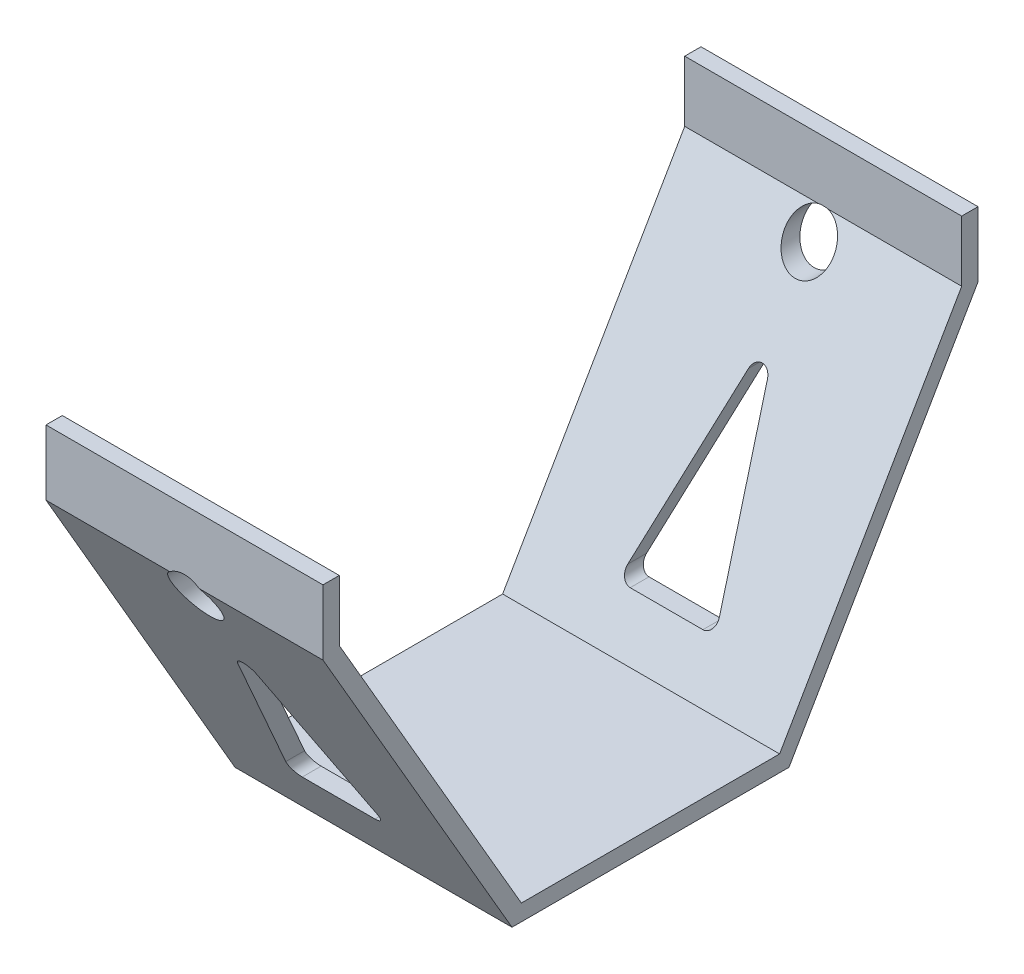
ISO-10303-21;
HEADER;
FILE_DESCRIPTION(('STEP AP214'),'2;1');
FILE_NAME('part.step','',(''),(''),'','','');
FILE_SCHEMA(('AUTOMOTIVE_DESIGN { 1 0 10303 214 1 1 1 1 }'));
ENDSEC;
DATA;
#1=APPLICATION_CONTEXT('core data for automotive mechanical design processes');
#2=APPLICATION_PROTOCOL_DEFINITION('international standard','automotive_design',2000,#1);
#3=PRODUCT_CONTEXT('',#1,'mechanical');
#4=PRODUCT('Part','Part','',(#3));
#5=PRODUCT_RELATED_PRODUCT_CATEGORY('part','',(#4));
#6=PRODUCT_DEFINITION_FORMATION('','',#4);
#7=PRODUCT_DEFINITION_CONTEXT('part definition',#1,'design');
#8=PRODUCT_DEFINITION('design','',#6,#7);
#9=PRODUCT_DEFINITION_SHAPE('','',#8);
#10=(LENGTH_UNIT() NAMED_UNIT(*) SI_UNIT(.MILLI.,.METRE.));
#11=(NAMED_UNIT(*) PLANE_ANGLE_UNIT() SI_UNIT($,.RADIAN.));
#12=(NAMED_UNIT(*) SI_UNIT($,.STERADIAN.) SOLID_ANGLE_UNIT());
#13=UNCERTAINTY_MEASURE_WITH_UNIT(LENGTH_MEASURE(1.E-05),#10,'distance_accuracy_value','');
#14=(GEOMETRIC_REPRESENTATION_CONTEXT(3) GLOBAL_UNCERTAINTY_ASSIGNED_CONTEXT((#13)) GLOBAL_UNIT_ASSIGNED_CONTEXT((#10,
#11,#12)) REPRESENTATION_CONTEXT('',''));
#15=CARTESIAN_POINT('',(0.,0.,0.));
#16=DIRECTION('',(0.,0.,1.));
#17=DIRECTION('',(1.,0.,0.));
#18=AXIS2_PLACEMENT_3D('',#15,#16,#17);
#19=CARTESIAN_POINT('',(42.5,0.,-95.5));
#20=DIRECTION('',(0.,0.,1.));
#21=DIRECTION('',(1.,0.,0.));
#22=AXIS2_PLACEMENT_3D('',#19,#20,#21);
#23=PLANE('',#22);
#24=CARTESIAN_POINT('',(0.,94.,-95.5));
#25=DIRECTION('',(0.,0.,1.));
#26=DIRECTION('',(1.,0.,0.));
#27=AXIS2_PLACEMENT_3D('',#24,#25,#26);
#28=CIRCLE('',#27,7.5);
#29=CARTESIAN_POINT('',(1.51657582993524,101.345066218358,-95.5));
#30=VERTEX_POINT('',#29);
#31=CARTESIAN_POINT('',(-1.5165758299352,101.345066218358,-95.5));
#32=VERTEX_POINT('',#31);
#33=EDGE_CURVE('E51',#30,#32,#28,.T.);
#34=ORIENTED_EDGE('',*,*,#33,.F.);
#35=DIRECTION('',(-1.,0.,0.));
#36=VECTOR('',#35,1.);
#37=CARTESIAN_POINT('',(42.5,101.345066218358,-95.5));
#38=LINE('',#37,#36);
#39=CARTESIAN_POINT('',(42.5,101.345066218358,-95.5));
#40=VERTEX_POINT('',#39);
#41=EDGE_CURVE('E271',#40,#30,#38,.T.);
#42=ORIENTED_EDGE('',*,*,#41,.F.);
#43=DIRECTION('',(0.,1.,0.));
#44=VECTOR('',#43,1.);
#45=CARTESIAN_POINT('',(42.5,0.,-95.5));
#46=LINE('',#45,#44);
#47=CARTESIAN_POINT('',(42.5,120.,-95.5));
#48=VERTEX_POINT('',#47);
#49=EDGE_CURVE('E388',#40,#48,#46,.T.);
#50=ORIENTED_EDGE('',*,*,#49,.T.);
#51=DIRECTION('',(-1.,0.,0.));
#52=VECTOR('',#51,1.);
#53=CARTESIAN_POINT('',(42.5,120.,-95.5));
#54=LINE('',#53,#52);
#55=CARTESIAN_POINT('',(-42.5,120.,-95.5));
#56=VERTEX_POINT('',#55);
#57=EDGE_CURVE('E444',#48,#56,#54,.T.);
#58=ORIENTED_EDGE('',*,*,#57,.T.);
#59=DIRECTION('',(0.,1.,0.));
#60=VECTOR('',#59,1.);
#61=CARTESIAN_POINT('',(-42.5,0.,-95.5));
#62=LINE('',#61,#60);
#63=CARTESIAN_POINT('',(-42.5,101.345066218358,-95.5));
#64=VERTEX_POINT('',#63);
#65=EDGE_CURVE('E387',#64,#56,#62,.T.);
#66=ORIENTED_EDGE('',*,*,#65,.F.);
#67=EDGE_CURVE('E270',#32,#64,#38,.T.);
#68=ORIENTED_EDGE('',*,*,#67,.F.);
#69=EDGE_LOOP('',(#34,#42,#50,#58,#66,#68));
#70=FACE_BOUND('',#69,.T.);
#71=ADVANCED_FACE('F37',(#70),#23,.T.);
#72=CARTESIAN_POINT('',(42.5,-15.9364858755945,-27.4766997855078));
#73=DIRECTION('',(0.,-0.501718089771846,-0.865031189261803));
#74=DIRECTION('',(0.,0.865031189261803,-0.501718089771846));
#75=AXIS2_PLACEMENT_3D('',#72,#73,#74);
#76=PLANE('',#75);
#77=DIRECTION('',(-1.,0.,0.));
#78=VECTOR('',#77,1.);
#79=CARTESIAN_POINT('',(42.5,18.4508732143203,-47.4213680576584));
#80=LINE('',#79,#78);
#81=CARTESIAN_POINT('',(11.1576707807868,18.4508732143203,-47.4213680576584));
#82=VERTEX_POINT('',#81);
#83=CARTESIAN_POINT('',(-11.1576707807868,18.4508732143203,-47.4213680576584));
#84=VERTEX_POINT('',#83);
#85=EDGE_CURVE('E354',#82,#84,#80,.T.);
#86=ORIENTED_EDGE('',*,*,#85,.T.);
#87=CARTESIAN_POINT('',(-11.1576707807868,21.4508732143203,-49.1613680576584));
#88=DIRECTION('',(0.,-0.501718089771846,-0.865031189261803));
#89=DIRECTION('',(0.,0.865031189261803,-0.501718089771846));
#90=AXIS2_PLACEMENT_3D('',#87,#88,#89);
#91=ELLIPSE('',#90,3.46808304398842,3.);
#92=CARTESIAN_POINT('',(-14.0680982812228,22.1784800894293,-49.5833800452217));
#93=VERTEX_POINT('',#92);
#94=EDGE_CURVE('E320',#84,#93,#91,.T.);
#95=ORIENTED_EDGE('',*,*,#94,.T.);
#96=DIRECTION('',(0.211371618850005,0.845486475400022,-0.490382155732013));
#97=VECTOR('',#96,1.);
#98=CARTESIAN_POINT('',(-20.643767726028,-4.12419768979163,-34.3278269332735));
#99=LINE('',#98,#97);
#100=CARTESIAN_POINT('',(-2.910427500436,66.8091632125764,-75.4691762566469));
#101=VERTEX_POINT('',#100);
#102=EDGE_CURVE('E366',#93,#101,#99,.T.);
#103=ORIENTED_EDGE('',*,*,#102,.T.);
#104=CARTESIAN_POINT('',(0.,66.0815563374673,-75.0471642690837));
#105=DIRECTION('',(0.,-0.501718089771846,-0.865031189261803));
#106=DIRECTION('',(0.,0.865031189261803,-0.501718089771846));
#107=AXIS2_PLACEMENT_3D('',#104,#105,#106);
#108=ELLIPSE('',#107,3.46808304398842,3.);
#109=CARTESIAN_POINT('',(2.91042750043599,66.8091632125764,-75.4691762566469));
#110=VERTEX_POINT('',#109);
#111=EDGE_CURVE('E316',#101,#110,#108,.T.);
#112=ORIENTED_EDGE('',*,*,#111,.T.);
#113=DIRECTION('',(0.211371618850005,-0.845486475400022,0.490382155732013));
#114=VECTOR('',#113,1.);
#115=CARTESIAN_POINT('',(24.4413944327261,-19.3147045165841,-25.5173329737338));
#116=LINE('',#115,#114);
#117=CARTESIAN_POINT('',(14.0680982812227,22.1784800894293,-49.5833800452217));
#118=VERTEX_POINT('',#117);
#119=EDGE_CURVE('E381',#110,#118,#116,.T.);
#120=ORIENTED_EDGE('',*,*,#119,.T.);
#121=CARTESIAN_POINT('',(11.1576707807868,21.4508732143203,-49.1613680576584));
#122=DIRECTION('',(0.,-0.501718089771846,-0.865031189261803));
#123=DIRECTION('',(0.,0.865031189261803,-0.501718089771846));
#124=AXIS2_PLACEMENT_3D('',#121,#122,#123);
#125=ELLIPSE('',#124,3.46808304398842,3.);
#126=EDGE_CURVE('E324',#118,#82,#125,.T.);
#127=ORIENTED_EDGE('',*,*,#126,.T.);
#128=EDGE_LOOP('',(#86,#95,#103,#112,#120,#127));
#129=FACE_BOUND('',#128,.T.);
#130=ORIENTED_EDGE('',*,*,#41,.T.);
#131=CARTESIAN_POINT('',(0.,94.,-91.2398615933527));
#132=DIRECTION('',(0.,-0.501718089771846,-0.865031189261803));
#133=DIRECTION('',(0.,-0.865031189261803,0.501718089771846));
#134=AXIS2_PLACEMENT_3D('',#131,#132,#133);
#135=ELLIPSE('',#134,8.67020760997106,7.5);
#136=EDGE_CURVE('E497',#30,#32,#135,.T.);
#137=ORIENTED_EDGE('',*,*,#136,.T.);
#138=ORIENTED_EDGE('',*,*,#67,.T.);
#139=DIRECTION('',(0.,-0.865031189261803,0.501718089771846));
#140=VECTOR('',#139,1.);
#141=CARTESIAN_POINT('',(-42.5,-15.9364858755945,-27.4766997855078));
#142=LINE('',#141,#140);
#143=CARTESIAN_POINT('',(-42.5,5.,-39.6198615933526));
#144=VERTEX_POINT('',#143);
#145=EDGE_CURVE('E417',#64,#144,#142,.T.);
#146=ORIENTED_EDGE('',*,*,#145,.T.);
#147=DIRECTION('',(-1.,0.,0.));
#148=VECTOR('',#147,1.);
#149=CARTESIAN_POINT('',(42.5,5.,-39.6198615933526));
#150=LINE('',#149,#148);
#151=CARTESIAN_POINT('',(42.5,5.,-39.6198615933526));
#152=VERTEX_POINT('',#151);
#153=EDGE_CURVE('E268',#152,#144,#150,.T.);
#154=ORIENTED_EDGE('',*,*,#153,.F.);
#155=DIRECTION('',(0.,-0.865031189261803,0.501718089771846));
#156=VECTOR('',#155,1.);
#157=CARTESIAN_POINT('',(42.5,-15.9364858755945,-27.4766997855078));
#158=LINE('',#157,#156);
#159=EDGE_CURVE('E391',#40,#152,#158,.T.);
#160=ORIENTED_EDGE('',*,*,#159,.F.);
#161=EDGE_LOOP('',(#130,#137,#138,#146,#154,#160));
#162=FACE_BOUND('',#161,.T.);
#163=ADVANCED_FACE('F460',(#129,#162),#76,.F.);
#164=CARTESIAN_POINT('',(42.5,5.,0.));
#165=DIRECTION('',(0.,1.,0.));
#166=DIRECTION('',(0.,0.,1.));
#167=AXIS2_PLACEMENT_3D('',#164,#165,#166);
#168=PLANE('',#167);
#169=DIRECTION('',(0.,0.,-1.));
#170=VECTOR('',#169,1.);
#171=CARTESIAN_POINT('',(-42.5,5.,0.));
#172=LINE('',#171,#170);
#173=CARTESIAN_POINT('',(-42.5,5.,39.6198615933526));
#174=VERTEX_POINT('',#173);
#175=EDGE_CURVE('E420',#174,#144,#172,.T.);
#176=ORIENTED_EDGE('',*,*,#175,.F.);
#177=DIRECTION('',(-1.,0.,0.));
#178=VECTOR('',#177,1.);
#179=CARTESIAN_POINT('',(42.5,5.,39.6198615933526));
#180=LINE('',#179,#178);
#181=CARTESIAN_POINT('',(42.5,5.,39.6198615933526));
#182=VERTEX_POINT('',#181);
#183=EDGE_CURVE('E266',#182,#174,#180,.T.);
#184=ORIENTED_EDGE('',*,*,#183,.F.);
#185=DIRECTION('',(0.,0.,-1.));
#186=VECTOR('',#185,1.);
#187=CARTESIAN_POINT('',(42.5,5.,0.));
#188=LINE('',#187,#186);
#189=EDGE_CURVE('E394',#182,#152,#188,.T.);
#190=ORIENTED_EDGE('',*,*,#189,.T.);
#191=ORIENTED_EDGE('',*,*,#153,.T.);
#192=EDGE_LOOP('',(#176,#184,#190,#191));
#193=FACE_BOUND('',#192,.T.);
#194=ADVANCED_FACE('F506',(#193),#168,.T.);
#195=CARTESIAN_POINT('',(42.5,-15.9364858755945,27.4766997855078));
#196=DIRECTION('',(0.,0.501718089771846,-0.865031189261803));
#197=DIRECTION('',(0.,0.865031189261804,0.501718089771846));
#198=AXIS2_PLACEMENT_3D('',#195,#196,#197);
#199=PLANE('',#198);
#200=CARTESIAN_POINT('',(0.,94.,91.2398615933526));
#201=DIRECTION('',(0.,0.501718089771846,-0.865031189261803));
#202=DIRECTION('',(0.,0.865031189261804,0.501718089771846));
#203=AXIS2_PLACEMENT_3D('',#200,#201,#202);
#204=ELLIPSE('',#203,8.67020760997106,7.5);
#205=CARTESIAN_POINT('',(1.51657582993516,101.345066218358,95.5));
#206=VERTEX_POINT('',#205);
#207=CARTESIAN_POINT('',(-1.51657582993516,101.345066218358,95.5));
#208=VERTEX_POINT('',#207);
#209=EDGE_CURVE('E58',#206,#208,#204,.T.);
#210=ORIENTED_EDGE('',*,*,#209,.F.);
#211=DIRECTION('',(-1.,0.,0.));
#212=VECTOR('',#211,1.);
#213=CARTESIAN_POINT('',(42.5,101.345066218358,95.5));
#214=LINE('',#213,#212);
#215=CARTESIAN_POINT('',(42.5,101.345066218358,95.5));
#216=VERTEX_POINT('',#215);
#217=EDGE_CURVE('E263',#216,#206,#214,.T.);
#218=ORIENTED_EDGE('',*,*,#217,.F.);
#219=DIRECTION('',(0.,-0.865031189261803,-0.501718089771846));
#220=VECTOR('',#219,1.);
#221=CARTESIAN_POINT('',(42.5,-15.9364858755945,27.4766997855078));
#222=LINE('',#221,#220);
#223=EDGE_CURVE('E397',#216,#182,#222,.T.);
#224=ORIENTED_EDGE('',*,*,#223,.T.);
#225=ORIENTED_EDGE('',*,*,#183,.T.);
#226=DIRECTION('',(0.,-0.865031189261803,-0.501718089771846));
#227=VECTOR('',#226,1.);
#228=CARTESIAN_POINT('',(-42.5,-15.9364858755945,27.4766997855078));
#229=LINE('',#228,#227);
#230=CARTESIAN_POINT('',(-42.5,101.345066218358,95.5));
#231=VERTEX_POINT('',#230);
#232=EDGE_CURVE('E423',#231,#174,#229,.T.);
#233=ORIENTED_EDGE('',*,*,#232,.F.);
#234=EDGE_CURVE('E262',#208,#231,#214,.T.);
#235=ORIENTED_EDGE('',*,*,#234,.F.);
#236=EDGE_LOOP('',(#210,#218,#224,#225,#233,#235));
#237=FACE_BOUND('',#236,.T.);
#238=DIRECTION('',(0.211371618850006,-0.845486475400022,-0.490382155732013));
#239=VECTOR('',#238,1.);
#240=CARTESIAN_POINT('',(24.4413944327261,-19.3147045165841,25.5173329737339));
#241=LINE('',#240,#239);
#242=CARTESIAN_POINT('',(2.91042750043599,66.8091632125764,75.4691762566469));
#243=VERTEX_POINT('',#242);
#244=CARTESIAN_POINT('',(14.0680982812227,22.1784800894293,49.5833800452216));
#245=VERTEX_POINT('',#244);
#246=EDGE_CURVE('E353',#243,#245,#241,.T.);
#247=ORIENTED_EDGE('',*,*,#246,.F.);
#248=CARTESIAN_POINT('',(0.,66.0815563374673,75.0471642690837));
#249=DIRECTION('',(0.,0.501718089771846,-0.865031189261803));
#250=DIRECTION('',(0.,-0.865031189261804,-0.501718089771846));
#251=AXIS2_PLACEMENT_3D('',#248,#249,#250);
#252=ELLIPSE('',#251,3.46808304398842,3.);
#253=CARTESIAN_POINT('',(-2.91042750043601,66.8091632125764,75.4691762566469));
#254=VERTEX_POINT('',#253);
#255=EDGE_CURVE('E11',#243,#254,#252,.F.);
#256=ORIENTED_EDGE('',*,*,#255,.T.);
#257=DIRECTION('',(0.211371618850006,0.845486475400022,0.490382155732013));
#258=VECTOR('',#257,1.);
#259=CARTESIAN_POINT('',(-20.643767726028,-4.12419768979163,34.3278269332735));
#260=LINE('',#259,#258);
#261=CARTESIAN_POINT('',(-14.0680982812228,22.1784800894293,49.5833800452216));
#262=VERTEX_POINT('',#261);
#263=EDGE_CURVE('E361',#262,#254,#260,.T.);
#264=ORIENTED_EDGE('',*,*,#263,.F.);
#265=CARTESIAN_POINT('',(-11.1576707807868,21.4508732143203,49.1613680576584));
#266=DIRECTION('',(0.,0.501718089771846,-0.865031189261803));
#267=DIRECTION('',(0.,-0.865031189261804,-0.501718089771846));
#268=AXIS2_PLACEMENT_3D('',#265,#266,#267);
#269=ELLIPSE('',#268,3.46808304398842,3.);
#270=CARTESIAN_POINT('',(-11.1576707807868,18.4508732143203,47.4213680576584));
#271=VERTEX_POINT('',#270);
#272=EDGE_CURVE('E334',#262,#271,#269,.F.);
#273=ORIENTED_EDGE('',*,*,#272,.T.);
#274=DIRECTION('',(-1.,0.,0.));
#275=VECTOR('',#274,1.);
#276=CARTESIAN_POINT('',(42.5,18.4508732143203,47.4213680576584));
#277=LINE('',#276,#275);
#278=CARTESIAN_POINT('',(11.1576707807868,18.4508732143203,47.4213680576584));
#279=VERTEX_POINT('',#278);
#280=EDGE_CURVE('E375',#279,#271,#277,.T.);
#281=ORIENTED_EDGE('',*,*,#280,.F.);
#282=CARTESIAN_POINT('',(11.1576707807868,21.4508732143203,49.1613680576584));
#283=DIRECTION('',(0.,0.501718089771846,-0.865031189261803));
#284=DIRECTION('',(0.,-0.865031189261804,-0.501718089771846));
#285=AXIS2_PLACEMENT_3D('',#282,#283,#284);
#286=ELLIPSE('',#285,3.46808304398842,3.);
#287=EDGE_CURVE('E330',#279,#245,#286,.F.);
#288=ORIENTED_EDGE('',*,*,#287,.T.);
#289=EDGE_LOOP('',(#247,#256,#264,#273,#281,#288));
#290=FACE_BOUND('',#289,.T.);
#291=ADVANCED_FACE('F360',(#237,#290),#199,.T.);
#292=CARTESIAN_POINT('',(42.5,0.,95.5));
#293=DIRECTION('',(0.,0.,-1.));
#294=DIRECTION('',(-1.,0.,0.));
#295=AXIS2_PLACEMENT_3D('',#292,#293,#294);
#296=PLANE('',#295);
#297=CARTESIAN_POINT('',(0.,94.,95.5));
#298=DIRECTION('',(0.,0.,-1.));
#299=DIRECTION('',(-1.,0.,0.));
#300=AXIS2_PLACEMENT_3D('',#297,#298,#299);
#301=CIRCLE('',#300,7.5);
#302=EDGE_CURVE('E471',#208,#206,#301,.T.);
#303=ORIENTED_EDGE('',*,*,#302,.F.);
#304=ORIENTED_EDGE('',*,*,#234,.T.);
#305=DIRECTION('',(0.,-1.,0.));
#306=VECTOR('',#305,1.);
#307=CARTESIAN_POINT('',(-42.5,0.,95.5));
#308=LINE('',#307,#306);
#309=CARTESIAN_POINT('',(-42.5,120.,95.5));
#310=VERTEX_POINT('',#309);
#311=EDGE_CURVE('E426',#310,#231,#308,.T.);
#312=ORIENTED_EDGE('',*,*,#311,.F.);
#313=DIRECTION('',(-1.,0.,0.));
#314=VECTOR('',#313,1.);
#315=CARTESIAN_POINT('',(42.5,120.,95.5));
#316=LINE('',#315,#314);
#317=CARTESIAN_POINT('',(42.5,120.,95.5));
#318=VERTEX_POINT('',#317);
#319=EDGE_CURVE('E260',#318,#310,#316,.T.);
#320=ORIENTED_EDGE('',*,*,#319,.F.);
#321=DIRECTION('',(0.,-1.,0.));
#322=VECTOR('',#321,1.);
#323=CARTESIAN_POINT('',(42.5,0.,95.5));
#324=LINE('',#323,#322);
#325=EDGE_CURVE('E400',#318,#216,#324,.T.);
#326=ORIENTED_EDGE('',*,*,#325,.T.);
#327=ORIENTED_EDGE('',*,*,#217,.T.);
#328=EDGE_LOOP('',(#303,#304,#312,#320,#326,#327));
#329=FACE_BOUND('',#328,.T.);
#330=ADVANCED_FACE('F470',(#329),#296,.T.);
#331=CARTESIAN_POINT('',(42.5,120.,0.));
#332=DIRECTION('',(0.,-1.,0.));
#333=DIRECTION('',(0.,0.,-1.));
#334=AXIS2_PLACEMENT_3D('',#331,#332,#333);
#335=PLANE('',#334);
#336=DIRECTION('',(0.,0.,1.));
#337=VECTOR('',#336,1.);
#338=CARTESIAN_POINT('',(-42.5,120.,0.));
#339=LINE('',#338,#337);
#340=CARTESIAN_POINT('',(-42.5,120.,100.5));
#341=VERTEX_POINT('',#340);
#342=EDGE_CURVE('E429',#310,#341,#339,.T.);
#343=ORIENTED_EDGE('',*,*,#342,.T.);
#344=DIRECTION('',(-1.,0.,0.));
#345=VECTOR('',#344,1.);
#346=CARTESIAN_POINT('',(42.5,120.,100.5));
#347=LINE('',#346,#345);
#348=CARTESIAN_POINT('',(42.5,120.,100.5));
#349=VERTEX_POINT('',#348);
#350=EDGE_CURVE('E257',#349,#341,#347,.T.);
#351=ORIENTED_EDGE('',*,*,#350,.F.);
#352=DIRECTION('',(0.,0.,1.));
#353=VECTOR('',#352,1.);
#354=CARTESIAN_POINT('',(42.5,120.,0.));
#355=LINE('',#354,#353);
#356=EDGE_CURVE('E403',#318,#349,#355,.T.);
#357=ORIENTED_EDGE('',*,*,#356,.F.);
#358=ORIENTED_EDGE('',*,*,#319,.T.);
#359=EDGE_LOOP('',(#343,#351,#357,#358));
#360=FACE_BOUND('',#359,.T.);
#361=ADVANCED_FACE('F478',(#360),#335,.F.);
#362=CARTESIAN_POINT('',(42.5,0.,100.5));
#363=DIRECTION('',(0.,0.,-1.));
#364=DIRECTION('',(-1.,0.,0.));
#365=AXIS2_PLACEMENT_3D('',#362,#363,#364);
#366=PLANE('',#365);
#367=DIRECTION('',(-1.,0.,0.));
#368=VECTOR('',#367,1.);
#369=CARTESIAN_POINT('',(42.5,100.,100.5));
#370=LINE('',#369,#368);
#371=CARTESIAN_POINT('',(-4.50000000000009,100.,100.5));
#372=VERTEX_POINT('',#371);
#373=CARTESIAN_POINT('',(-42.5,100.,100.5));
#374=VERTEX_POINT('',#373);
#375=EDGE_CURVE('E253',#372,#374,#370,.T.);
#376=ORIENTED_EDGE('',*,*,#375,.F.);
#377=CARTESIAN_POINT('',(0.,94.,100.5));
#378=DIRECTION('',(0.,0.,1.));
#379=DIRECTION('',(1.,0.,0.));
#380=AXIS2_PLACEMENT_3D('',#377,#378,#379);
#381=CIRCLE('',#380,7.5);
#382=CARTESIAN_POINT('',(4.50000000000009,99.9999999999999,100.5));
#383=VERTEX_POINT('',#382);
#384=EDGE_CURVE('E227',#383,#372,#381,.T.);
#385=ORIENTED_EDGE('',*,*,#384,.F.);
#386=CARTESIAN_POINT('',(42.5,100.,100.5));
#387=VERTEX_POINT('',#386);
#388=EDGE_CURVE('E254',#387,#383,#370,.T.);
#389=ORIENTED_EDGE('',*,*,#388,.F.);
#390=DIRECTION('',(0.,-1.,0.));
#391=VECTOR('',#390,1.);
#392=CARTESIAN_POINT('',(42.5,0.,100.5));
#393=LINE('',#392,#391);
#394=EDGE_CURVE('E405',#349,#387,#393,.T.);
#395=ORIENTED_EDGE('',*,*,#394,.F.);
#396=ORIENTED_EDGE('',*,*,#350,.T.);
#397=DIRECTION('',(0.,-1.,0.));
#398=VECTOR('',#397,1.);
#399=CARTESIAN_POINT('',(-42.5,0.,100.5));
#400=LINE('',#399,#398);
#401=EDGE_CURVE('E431',#341,#374,#400,.T.);
#402=ORIENTED_EDGE('',*,*,#401,.T.);
#403=EDGE_LOOP('',(#376,#385,#389,#395,#396,#402));
#404=FACE_BOUND('',#403,.T.);
#405=ADVANCED_FACE('F483',(#404),#366,.F.);
#406=CARTESIAN_POINT('',(42.5,-18.4450763244538,31.8018557318168));
#407=DIRECTION('',(0.,0.501718089771846,-0.865031189261803));
#408=DIRECTION('',(0.,0.865031189261803,0.501718089771846));
#409=AXIS2_PLACEMENT_3D('',#406,#407,#408);
#410=PLANE('',#409);
#411=DIRECTION('',(-1.,0.,0.));
#412=VECTOR('',#411,1.);
#413=CARTESIAN_POINT('',(42.5,18.4508732143203,53.2015064643058));
#414=LINE('',#413,#412);
#415=CARTESIAN_POINT('',(11.1576707807868,18.4508732143203,53.2015064643058));
#416=VERTEX_POINT('',#415);
#417=CARTESIAN_POINT('',(-11.1576707807868,18.4508732143203,53.2015064643058));
#418=VERTEX_POINT('',#417);
#419=EDGE_CURVE('E369',#416,#418,#414,.T.);
#420=ORIENTED_EDGE('',*,*,#419,.T.);
#421=CARTESIAN_POINT('',(-11.1576707807868,21.4508732143203,54.9415064643058));
#422=DIRECTION('',(0.,0.501718089771846,-0.865031189261803));
#423=DIRECTION('',(0.,-0.865031189261803,-0.501718089771846));
#424=AXIS2_PLACEMENT_3D('',#421,#422,#423);
#425=ELLIPSE('',#424,3.46808304398842,3.);
#426=CARTESIAN_POINT('',(-14.0680982812228,22.1784800894293,55.363518451869));
#427=VERTEX_POINT('',#426);
#428=EDGE_CURVE('E332',#418,#427,#425,.T.);
#429=ORIENTED_EDGE('',*,*,#428,.T.);
#430=DIRECTION('',(0.211371618850005,0.845486475400022,0.490382155732013));
#431=VECTOR('',#430,1.);
#432=CARTESIAN_POINT('',(-21.2428956615229,-6.52070943177138,38.7179885295726));
#433=LINE('',#432,#431);
#434=CARTESIAN_POINT('',(-2.91042750043601,66.8091632125763,81.2493146632943));
#435=VERTEX_POINT('',#434);
#436=EDGE_CURVE('E344',#427,#435,#433,.T.);
#437=ORIENTED_EDGE('',*,*,#436,.T.);
#438=CARTESIAN_POINT('',(0.,66.0815563374673,80.8273026757311));
#439=DIRECTION('',(0.,0.501718089771846,-0.865031189261803));
#440=DIRECTION('',(0.,-0.865031189261803,-0.501718089771846));
#441=AXIS2_PLACEMENT_3D('',#438,#439,#440);
#442=ELLIPSE('',#441,3.46808304398842,3.);
#443=CARTESIAN_POINT('',(2.91042750043599,66.8091632125763,81.2493146632943));
#444=VERTEX_POINT('',#443);
#445=EDGE_CURVE('E45',#435,#444,#442,.T.);
#446=ORIENTED_EDGE('',*,*,#445,.T.);
#447=DIRECTION('',(0.211371618850005,-0.845486475400022,-0.490382155732013));
#448=VECTOR('',#447,1.);
#449=CARTESIAN_POINT('',(25.040522368221,-21.7112162585639,29.907494570033));
#450=LINE('',#449,#448);
#451=CARTESIAN_POINT('',(14.0680982812227,22.1784800894293,55.363518451869));
#452=VERTEX_POINT('',#451);
#453=EDGE_CURVE('E342',#444,#452,#450,.T.);
#454=ORIENTED_EDGE('',*,*,#453,.T.);
#455=CARTESIAN_POINT('',(11.1576707807868,21.4508732143203,54.9415064643058));
#456=DIRECTION('',(0.,0.501718089771846,-0.865031189261803));
#457=DIRECTION('',(0.,-0.865031189261803,-0.501718089771846));
#458=AXIS2_PLACEMENT_3D('',#455,#456,#457);
#459=ELLIPSE('',#458,3.46808304398842,3.);
#460=EDGE_CURVE('E328',#452,#416,#459,.T.);
#461=ORIENTED_EDGE('',*,*,#460,.T.);
#462=EDGE_LOOP('',(#420,#429,#437,#446,#454,#461));
#463=FACE_BOUND('',#462,.T.);
#464=ORIENTED_EDGE('',*,*,#388,.T.);
#465=CARTESIAN_POINT('',(0.,94.,97.0200000000001));
#466=DIRECTION('',(0.,0.501718089771846,-0.865031189261803));
#467=DIRECTION('',(0.,0.865031189261803,0.501718089771846));
#468=AXIS2_PLACEMENT_3D('',#465,#466,#467);
#469=ELLIPSE('',#468,8.67020760997106,7.5);
#470=EDGE_CURVE('E237',#383,#372,#469,.T.);
#471=ORIENTED_EDGE('',*,*,#470,.T.);
#472=ORIENTED_EDGE('',*,*,#375,.T.);
#473=DIRECTION('',(0.,-0.865031189261803,-0.501718089771846));
#474=VECTOR('',#473,1.);
#475=CARTESIAN_POINT('',(-42.5,-18.4450763244538,31.8018557318168));
#476=LINE('',#475,#474);
#477=CARTESIAN_POINT('',(-42.5,0.,42.5));
#478=VERTEX_POINT('',#477);
#479=EDGE_CURVE('E434',#374,#478,#476,.T.);
#480=ORIENTED_EDGE('',*,*,#479,.T.);
#481=DIRECTION('',(-1.,0.,0.));
#482=VECTOR('',#481,1.);
#483=CARTESIAN_POINT('',(42.5,0.,42.5));
#484=LINE('',#483,#482);
#485=CARTESIAN_POINT('',(42.5,0.,42.5));
#486=VERTEX_POINT('',#485);
#487=EDGE_CURVE('E245',#486,#478,#484,.T.);
#488=ORIENTED_EDGE('',*,*,#487,.F.);
#489=DIRECTION('',(0.,-0.865031189261803,-0.501718089771846));
#490=VECTOR('',#489,1.);
#491=CARTESIAN_POINT('',(42.5,-18.4450763244538,31.8018557318168));
#492=LINE('',#491,#490);
#493=EDGE_CURVE('E408',#387,#486,#492,.T.);
#494=ORIENTED_EDGE('',*,*,#493,.F.);
#495=EDGE_LOOP('',(#464,#471,#472,#480,#488,#494));
#496=FACE_BOUND('',#495,.T.);
#497=ADVANCED_FACE('F340',(#463,#496),#410,.F.);
#498=CARTESIAN_POINT('',(42.5,0.,0.));
#499=DIRECTION('',(0.,1.,0.));
#500=DIRECTION('',(0.,0.,1.));
#501=AXIS2_PLACEMENT_3D('',#498,#499,#500);
#502=PLANE('',#501);
#503=CARTESIAN_POINT('',(0.,0.,0.));
#504=DIRECTION('',(0.,1.,0.));
#505=DIRECTION('',(0.,0.,1.));
#506=AXIS2_PLACEMENT_3D('',#503,#504,#505);
#507=CIRCLE('',#506,15.);
#508=CARTESIAN_POINT('',(0.,0.,15.));
#509=VERTEX_POINT('',#508);
#510=EDGE_CURVE('E274',#509,#509,#507,.F.);
#511=ORIENTED_EDGE('',*,*,#510,.F.);
#512=EDGE_LOOP('',(#511));
#513=FACE_BOUND('',#512,.T.);
#514=DIRECTION('',(0.,0.,-1.));
#515=VECTOR('',#514,1.);
#516=CARTESIAN_POINT('',(-42.5,0.,0.));
#517=LINE('',#516,#515);
#518=CARTESIAN_POINT('',(-42.5,0.,-42.5));
#519=VERTEX_POINT('',#518);
#520=EDGE_CURVE('E436',#478,#519,#517,.T.);
#521=ORIENTED_EDGE('',*,*,#520,.T.);
#522=DIRECTION('',(-1.,0.,0.));
#523=VECTOR('',#522,1.);
#524=CARTESIAN_POINT('',(42.5,0.,-42.5));
#525=LINE('',#524,#523);
#526=CARTESIAN_POINT('',(42.5,0.,-42.5));
#527=VERTEX_POINT('',#526);
#528=EDGE_CURVE('E243',#527,#519,#525,.T.);
#529=ORIENTED_EDGE('',*,*,#528,.F.);
#530=DIRECTION('',(0.,0.,-1.));
#531=VECTOR('',#530,1.);
#532=CARTESIAN_POINT('',(42.5,0.,0.));
#533=LINE('',#532,#531);
#534=EDGE_CURVE('E410',#486,#527,#533,.T.);
#535=ORIENTED_EDGE('',*,*,#534,.F.);
#536=ORIENTED_EDGE('',*,*,#487,.T.);
#537=EDGE_LOOP('',(#521,#529,#535,#536));
#538=FACE_BOUND('',#537,.T.);
#539=ADVANCED_FACE('F491',(#513,#538),#502,.F.);
#540=CARTESIAN_POINT('',(42.5,-18.4450763244538,-31.8018557318168));
#541=DIRECTION('',(0.,-0.501718089771846,-0.865031189261803));
#542=DIRECTION('',(0.,0.865031189261803,-0.501718089771846));
#543=AXIS2_PLACEMENT_3D('',#540,#541,#542);
#544=PLANE('',#543);
#545=CARTESIAN_POINT('',(0.,94.,-97.02));
#546=DIRECTION('',(0.,-0.501718089771846,-0.865031189261803));
#547=DIRECTION('',(0.,-0.865031189261803,0.501718089771846));
#548=AXIS2_PLACEMENT_3D('',#545,#546,#547);
#549=ELLIPSE('',#548,8.67020760997106,7.5);
#550=CARTESIAN_POINT('',(4.50000000000005,100.,-100.5));
#551=VERTEX_POINT('',#550);
#552=CARTESIAN_POINT('',(-4.50000000000005,100.,-100.5));
#553=VERTEX_POINT('',#552);
#554=EDGE_CURVE('E223',#551,#553,#549,.T.);
#555=ORIENTED_EDGE('',*,*,#554,.F.);
#556=DIRECTION('',(-1.,0.,0.));
#557=VECTOR('',#556,1.);
#558=CARTESIAN_POINT('',(42.5,100.,-100.5));
#559=LINE('',#558,#557);
#560=CARTESIAN_POINT('',(42.5,100.,-100.5));
#561=VERTEX_POINT('',#560);
#562=EDGE_CURVE('E233',#561,#551,#559,.T.);
#563=ORIENTED_EDGE('',*,*,#562,.F.);
#564=DIRECTION('',(0.,-0.865031189261803,0.501718089771846));
#565=VECTOR('',#564,1.);
#566=CARTESIAN_POINT('',(42.5,-18.4450763244538,-31.8018557318168));
#567=LINE('',#566,#565);
#568=EDGE_CURVE('E412',#561,#527,#567,.T.);
#569=ORIENTED_EDGE('',*,*,#568,.T.);
#570=ORIENTED_EDGE('',*,*,#528,.T.);
#571=DIRECTION('',(0.,-0.865031189261803,0.501718089771846));
#572=VECTOR('',#571,1.);
#573=CARTESIAN_POINT('',(-42.5,-18.4450763244538,-31.8018557318168));
#574=LINE('',#573,#572);
#575=CARTESIAN_POINT('',(-42.5,100.,-100.5));
#576=VERTEX_POINT('',#575);
#577=EDGE_CURVE('E439',#576,#519,#574,.T.);
#578=ORIENTED_EDGE('',*,*,#577,.F.);
#579=EDGE_CURVE('E236',#553,#576,#559,.T.);
#580=ORIENTED_EDGE('',*,*,#579,.F.);
#581=EDGE_LOOP('',(#555,#563,#569,#570,#578,#580));
#582=FACE_BOUND('',#581,.T.);
#583=DIRECTION('',(0.211371618850005,-0.845486475400022,0.490382155732013));
#584=VECTOR('',#583,1.);
#585=CARTESIAN_POINT('',(25.040522368221,-21.7112162585639,-29.907494570033));
#586=LINE('',#585,#584);
#587=CARTESIAN_POINT('',(2.91042750043599,66.8091632125763,-81.2493146632943));
#588=VERTEX_POINT('',#587);
#589=CARTESIAN_POINT('',(14.0680982812227,22.1784800894293,-55.363518451869));
#590=VERTEX_POINT('',#589);
#591=EDGE_CURVE('E283',#588,#590,#586,.T.);
#592=ORIENTED_EDGE('',*,*,#591,.F.);
#593=CARTESIAN_POINT('',(0.,66.0815563374673,-80.8273026757311));
#594=DIRECTION('',(0.,-0.501718089771846,-0.865031189261803));
#595=DIRECTION('',(0.,0.865031189261803,-0.501718089771846));
#596=AXIS2_PLACEMENT_3D('',#593,#594,#595);
#597=ELLIPSE('',#596,3.46808304398842,3.);
#598=CARTESIAN_POINT('',(-2.91042750043601,66.8091632125763,-81.2493146632943));
#599=VERTEX_POINT('',#598);
#600=EDGE_CURVE('E318',#588,#599,#597,.F.);
#601=ORIENTED_EDGE('',*,*,#600,.T.);
#602=DIRECTION('',(0.211371618850005,0.845486475400022,-0.490382155732013));
#603=VECTOR('',#602,1.);
#604=CARTESIAN_POINT('',(-21.2428956615229,-6.52070943177138,-38.7179885295726));
#605=LINE('',#604,#603);
#606=CARTESIAN_POINT('',(-14.0680982812228,22.1784800894293,-55.363518451869));
#607=VERTEX_POINT('',#606);
#608=EDGE_CURVE('E277',#607,#599,#605,.T.);
#609=ORIENTED_EDGE('',*,*,#608,.F.);
#610=CARTESIAN_POINT('',(-11.1576707807868,21.4508732143203,-54.9415064643058));
#611=DIRECTION('',(0.,-0.501718089771846,-0.865031189261803));
#612=DIRECTION('',(0.,0.865031189261803,-0.501718089771846));
#613=AXIS2_PLACEMENT_3D('',#610,#611,#612);
#614=ELLIPSE('',#613,3.46808304398842,3.);
#615=CARTESIAN_POINT('',(-11.1576707807868,18.4508732143203,-53.2015064643058));
#616=VERTEX_POINT('',#615);
#617=EDGE_CURVE('E322',#607,#616,#614,.F.);
#618=ORIENTED_EDGE('',*,*,#617,.T.);
#619=DIRECTION('',(-1.,0.,0.));
#620=VECTOR('',#619,1.);
#621=CARTESIAN_POINT('',(42.5,18.4508732143203,-53.2015064643058));
#622=LINE('',#621,#620);
#623=CARTESIAN_POINT('',(11.1576707807868,18.4508732143203,-53.2015064643058));
#624=VERTEX_POINT('',#623);
#625=EDGE_CURVE('E280',#624,#616,#622,.T.);
#626=ORIENTED_EDGE('',*,*,#625,.F.);
#627=CARTESIAN_POINT('',(11.1576707807868,21.4508732143203,-54.9415064643058));
#628=DIRECTION('',(0.,-0.501718089771846,-0.865031189261803));
#629=DIRECTION('',(0.,0.865031189261803,-0.501718089771846));
#630=AXIS2_PLACEMENT_3D('',#627,#628,#629);
#631=ELLIPSE('',#630,3.46808304398842,3.);
#632=EDGE_CURVE('E326',#624,#590,#631,.F.);
#633=ORIENTED_EDGE('',*,*,#632,.T.);
#634=EDGE_LOOP('',(#592,#601,#609,#618,#626,#633));
#635=FACE_BOUND('',#634,.T.);
#636=ADVANCED_FACE('F230',(#582,#635),#544,.T.);
#637=CARTESIAN_POINT('',(42.5,0.,-100.5));
#638=DIRECTION('',(0.,0.,-1.));
#639=DIRECTION('',(-1.,0.,0.));
#640=AXIS2_PLACEMENT_3D('',#637,#638,#639);
#641=PLANE('',#640);
#642=CARTESIAN_POINT('',(0.,94.,-100.5));
#643=DIRECTION('',(0.,0.,1.));
#644=DIRECTION('',(1.,0.,0.));
#645=AXIS2_PLACEMENT_3D('',#642,#643,#644);
#646=CIRCLE('',#645,7.5);
#647=EDGE_CURVE('E220',#551,#553,#646,.T.);
#648=ORIENTED_EDGE('',*,*,#647,.T.);
#649=ORIENTED_EDGE('',*,*,#579,.T.);
#650=DIRECTION('',(0.,-1.,0.));
#651=VECTOR('',#650,1.);
#652=CARTESIAN_POINT('',(-42.5,0.,-100.5));
#653=LINE('',#652,#651);
#654=CARTESIAN_POINT('',(-42.5,120.,-100.5));
#655=VERTEX_POINT('',#654);
#656=EDGE_CURVE('E442',#655,#576,#653,.T.);
#657=ORIENTED_EDGE('',*,*,#656,.F.);
#658=DIRECTION('',(-1.,0.,0.));
#659=VECTOR('',#658,1.);
#660=CARTESIAN_POINT('',(42.5,120.,-100.5));
#661=LINE('',#660,#659);
#662=CARTESIAN_POINT('',(42.5,120.,-100.5));
#663=VERTEX_POINT('',#662);
#664=EDGE_CURVE('E247',#663,#655,#661,.T.);
#665=ORIENTED_EDGE('',*,*,#664,.F.);
#666=DIRECTION('',(0.,-1.,0.));
#667=VECTOR('',#666,1.);
#668=CARTESIAN_POINT('',(42.5,0.,-100.5));
#669=LINE('',#668,#667);
#670=EDGE_CURVE('E242',#663,#561,#669,.T.);
#671=ORIENTED_EDGE('',*,*,#670,.T.);
#672=ORIENTED_EDGE('',*,*,#562,.T.);
#673=EDGE_LOOP('',(#648,#649,#657,#665,#671,#672));
#674=FACE_BOUND('',#673,.T.);
#675=ADVANCED_FACE('F240',(#674),#641,.T.);
#676=EDGE_CURVE('E392',#655,#56,#339,.T.);
#677=ORIENTED_EDGE('',*,*,#676,.T.);
#678=ORIENTED_EDGE('',*,*,#57,.F.);
#679=EDGE_CURVE('E406',#663,#48,#355,.T.);
#680=ORIENTED_EDGE('',*,*,#679,.F.);
#681=ORIENTED_EDGE('',*,*,#664,.T.);
#682=EDGE_LOOP('',(#677,#678,#680,#681));
#683=FACE_BOUND('',#682,.T.);
#684=ADVANCED_FACE('F454',(#683),#335,.F.);
#685=CARTESIAN_POINT('',(42.5,0.,0.));
#686=DIRECTION('',(1.,0.,0.));
#687=DIRECTION('',(0.,0.,-1.));
#688=AXIS2_PLACEMENT_3D('',#685,#686,#687);
#689=PLANE('',#688);
#690=ORIENTED_EDGE('',*,*,#49,.F.);
#691=ORIENTED_EDGE('',*,*,#159,.T.);
#692=ORIENTED_EDGE('',*,*,#189,.F.);
#693=ORIENTED_EDGE('',*,*,#223,.F.);
#694=ORIENTED_EDGE('',*,*,#325,.F.);
#695=ORIENTED_EDGE('',*,*,#356,.T.);
#696=ORIENTED_EDGE('',*,*,#394,.T.);
#697=ORIENTED_EDGE('',*,*,#493,.T.);
#698=ORIENTED_EDGE('',*,*,#534,.T.);
#699=ORIENTED_EDGE('',*,*,#568,.F.);
#700=ORIENTED_EDGE('',*,*,#670,.F.);
#701=ORIENTED_EDGE('',*,*,#679,.T.);
#702=EDGE_LOOP('',(#690,#691,#692,#693,#694,#695,#696,#697,#698,#699,#700,#701));
#703=FACE_BOUND('',#702,.T.);
#704=ADVANCED_FACE('F452',(#703),#689,.T.);
#705=CARTESIAN_POINT('',(-42.5,0.,0.));
#706=DIRECTION('',(1.,0.,0.));
#707=DIRECTION('',(0.,0.,-1.));
#708=AXIS2_PLACEMENT_3D('',#705,#706,#707);
#709=PLANE('',#708);
#710=ORIENTED_EDGE('',*,*,#65,.T.);
#711=ORIENTED_EDGE('',*,*,#676,.F.);
#712=ORIENTED_EDGE('',*,*,#656,.T.);
#713=ORIENTED_EDGE('',*,*,#577,.T.);
#714=ORIENTED_EDGE('',*,*,#520,.F.);
#715=ORIENTED_EDGE('',*,*,#479,.F.);
#716=ORIENTED_EDGE('',*,*,#401,.F.);
#717=ORIENTED_EDGE('',*,*,#342,.F.);
#718=ORIENTED_EDGE('',*,*,#311,.T.);
#719=ORIENTED_EDGE('',*,*,#232,.T.);
#720=ORIENTED_EDGE('',*,*,#175,.T.);
#721=ORIENTED_EDGE('',*,*,#145,.F.);
#722=EDGE_LOOP('',(#710,#711,#712,#713,#714,#715,#716,#717,#718,#719,#720,#721));
#723=FACE_BOUND('',#722,.T.);
#724=ADVANCED_FACE('F495',(#723),#709,.F.);
#725=CARTESIAN_POINT('',(0.,-22.,0.));
#726=DIRECTION('',(0.,1.,0.));
#727=DIRECTION('',(0.,0.,1.));
#728=AXIS2_PLACEMENT_3D('',#725,#726,#727);
#729=CYLINDRICAL_SURFACE('',#728,15.);
#730=CARTESIAN_POINT('',(0.,-22.,0.));
#731=DIRECTION('',(0.,-1.,0.));
#732=DIRECTION('',(0.,0.,-1.));
#733=AXIS2_PLACEMENT_3D('',#730,#731,#732);
#734=CIRCLE('',#733,15.);
#735=CARTESIAN_POINT('',(0.,-22.,-15.));
#736=VERTEX_POINT('',#735);
#737=EDGE_CURVE('E384',#736,#736,#734,.T.);
#738=ORIENTED_EDGE('',*,*,#737,.F.);
#739=EDGE_LOOP('',(#738));
#740=FACE_BOUND('',#739,.T.);
#741=ORIENTED_EDGE('',*,*,#510,.T.);
#742=EDGE_LOOP('',(#741));
#743=FACE_BOUND('',#742,.T.);
#744=ADVANCED_FACE('F615',(#740,#743),#729,.T.);
#745=CARTESIAN_POINT('',(0.,-22.,0.));
#746=DIRECTION('',(0.,-1.,0.));
#747=DIRECTION('',(0.,0.,-1.));
#748=AXIS2_PLACEMENT_3D('',#745,#746,#747);
#749=PLANE('',#748);
#750=ORIENTED_EDGE('',*,*,#737,.T.);
#751=EDGE_LOOP('',(#750));
#752=FACE_BOUND('',#751,.T.);
#753=ADVANCED_FACE('F568',(#752),#749,.T.);
#754=CARTESIAN_POINT('',(0.,78.4508732143203,-100.5));
#755=DIRECTION('',(-0.970142500145332,0.242535625036333,0.));
#756=DIRECTION('',(-0.242535625036333,-0.970142500145332,0.));
#757=AXIS2_PLACEMENT_3D('',#754,#755,#756);
#758=PLANE('',#757);
#759=ORIENTED_EDGE('',*,*,#608,.T.);
#760=DIRECTION('',(0.,0.,1.));
#761=VECTOR('',#760,1.);
#762=CARTESIAN_POINT('',(-2.91042750043599,66.8091632125763,-82.2213680576585));
#763=LINE('',#762,#761);
#764=EDGE_CURVE('E288',#599,#101,#763,.T.);
#765=ORIENTED_EDGE('',*,*,#764,.T.);
#766=ORIENTED_EDGE('',*,*,#102,.F.);
#767=DIRECTION('',(0.,0.,1.));
#768=VECTOR('',#767,1.);
#769=CARTESIAN_POINT('',(-14.0680982812228,22.1784800894293,-53.2015064643058));
#770=LINE('',#769,#768);
#771=EDGE_CURVE('E286',#93,#607,#770,.F.);
#772=ORIENTED_EDGE('',*,*,#771,.T.);
#773=EDGE_LOOP('',(#759,#765,#766,#772));
#774=FACE_BOUND('',#773,.T.);
#775=ADVANCED_FACE('F557',(#774),#758,.F.);
#776=CARTESIAN_POINT('',(-15.,18.4508732143203,-100.5));
#777=DIRECTION('',(0.,-1.,0.));
#778=DIRECTION('',(0.,0.,-1.));
#779=AXIS2_PLACEMENT_3D('',#776,#777,#778);
#780=PLANE('',#779);
#781=ORIENTED_EDGE('',*,*,#625,.T.);
#782=DIRECTION('',(0.,0.,1.));
#783=VECTOR('',#782,1.);
#784=CARTESIAN_POINT('',(-11.1576707807868,18.4508732143203,-47.4213680576585));
#785=LINE('',#784,#783);
#786=EDGE_CURVE('E298',#616,#84,#785,.T.);
#787=ORIENTED_EDGE('',*,*,#786,.T.);
#788=ORIENTED_EDGE('',*,*,#85,.F.);
#789=DIRECTION('',(0.,0.,1.));
#790=VECTOR('',#789,1.);
#791=CARTESIAN_POINT('',(11.1576707807868,18.4508732143203,-53.2015064643058));
#792=LINE('',#791,#790);
#793=EDGE_CURVE('E296',#82,#624,#792,.F.);
#794=ORIENTED_EDGE('',*,*,#793,.T.);
#795=EDGE_LOOP('',(#781,#787,#788,#794));
#796=FACE_BOUND('',#795,.T.);
#797=ADVANCED_FACE('F551',(#796),#780,.F.);
#798=CARTESIAN_POINT('',(0.,78.4508732143203,-100.5));
#799=DIRECTION('',(0.970142500145332,0.242535625036333,0.));
#800=DIRECTION('',(-0.242535625036333,0.970142500145332,0.));
#801=AXIS2_PLACEMENT_3D('',#798,#799,#800);
#802=PLANE('',#801);
#803=ORIENTED_EDGE('',*,*,#119,.F.);
#804=DIRECTION('',(0.,0.,1.));
#805=VECTOR('',#804,1.);
#806=CARTESIAN_POINT('',(2.91042750043599,66.8091632125763,-88.0015064643058));
#807=LINE('',#806,#805);
#808=EDGE_CURVE('E294',#110,#588,#807,.F.);
#809=ORIENTED_EDGE('',*,*,#808,.T.);
#810=ORIENTED_EDGE('',*,*,#591,.T.);
#811=DIRECTION('',(0.,0.,1.));
#812=VECTOR('',#811,1.);
#813=CARTESIAN_POINT('',(14.0680982812227,22.1784800894293,-47.4213680576584));
#814=LINE('',#813,#812);
#815=EDGE_CURVE('E291',#590,#118,#814,.T.);
#816=ORIENTED_EDGE('',*,*,#815,.T.);
#817=EDGE_LOOP('',(#803,#809,#810,#816));
#818=FACE_BOUND('',#817,.T.);
#819=ADVANCED_FACE('F558',(#818),#802,.F.);
#820=ORIENTED_EDGE('',*,*,#246,.T.);
#821=DIRECTION('',(0.,0.,1.));
#822=VECTOR('',#821,1.);
#823=CARTESIAN_POINT('',(14.0680982812227,22.1784800894293,53.2015064643058));
#824=LINE('',#823,#822);
#825=EDGE_CURVE('E303',#245,#452,#824,.T.);
#826=ORIENTED_EDGE('',*,*,#825,.T.);
#827=ORIENTED_EDGE('',*,*,#453,.F.);
#828=DIRECTION('',(0.,0.,1.));
#829=VECTOR('',#828,1.);
#830=CARTESIAN_POINT('',(2.91042750043599,66.8091632125763,82.2213680576584));
#831=LINE('',#830,#829);
#832=EDGE_CURVE('E301',#444,#243,#831,.F.);
#833=ORIENTED_EDGE('',*,*,#832,.T.);
#834=EDGE_LOOP('',(#820,#826,#827,#833));
#835=FACE_BOUND('',#834,.T.);
#836=ADVANCED_FACE('F350',(#835),#802,.F.);
#837=ORIENTED_EDGE('',*,*,#419,.F.);
#838=DIRECTION('',(0.,0.,1.));
#839=VECTOR('',#838,1.);
#840=CARTESIAN_POINT('',(11.1576707807868,18.4508732143203,47.4213680576584));
#841=LINE('',#840,#839);
#842=EDGE_CURVE('E309',#416,#279,#841,.F.);
#843=ORIENTED_EDGE('',*,*,#842,.T.);
#844=ORIENTED_EDGE('',*,*,#280,.T.);
#845=DIRECTION('',(0.,0.,1.));
#846=VECTOR('',#845,1.);
#847=CARTESIAN_POINT('',(-11.1576707807868,18.4508732143203,53.2015064643058));
#848=LINE('',#847,#846);
#849=EDGE_CURVE('E306',#271,#418,#848,.T.);
#850=ORIENTED_EDGE('',*,*,#849,.T.);
#851=EDGE_LOOP('',(#837,#843,#844,#850));
#852=FACE_BOUND('',#851,.T.);
#853=ADVANCED_FACE('F547',(#852),#780,.F.);
#854=ORIENTED_EDGE('',*,*,#436,.F.);
#855=DIRECTION('',(0.,0.,1.));
#856=VECTOR('',#855,1.);
#857=CARTESIAN_POINT('',(-14.0680982812228,22.1784800894293,47.4213680576584));
#858=LINE('',#857,#856);
#859=EDGE_CURVE('E314',#427,#262,#858,.F.);
#860=ORIENTED_EDGE('',*,*,#859,.T.);
#861=ORIENTED_EDGE('',*,*,#263,.T.);
#862=DIRECTION('',(0.,0.,1.));
#863=VECTOR('',#862,1.);
#864=CARTESIAN_POINT('',(-2.91042750043599,66.8091632125763,88.0015064643058));
#865=LINE('',#864,#863);
#866=EDGE_CURVE('E311',#254,#435,#865,.T.);
#867=ORIENTED_EDGE('',*,*,#866,.T.);
#868=EDGE_LOOP('',(#854,#860,#861,#867));
#869=FACE_BOUND('',#868,.T.);
#870=ADVANCED_FACE('F364',(#869),#758,.F.);
#871=CARTESIAN_POINT('',(0.,66.0815563374673,-100.5));
#872=DIRECTION('',(0.,0.,-1.));
#873=DIRECTION('',(-1.,0.,0.));
#874=AXIS2_PLACEMENT_3D('',#871,#872,#873);
#875=CYLINDRICAL_SURFACE('',#874,3.);
#876=ORIENTED_EDGE('',*,*,#600,.F.);
#877=ORIENTED_EDGE('',*,*,#808,.F.);
#878=ORIENTED_EDGE('',*,*,#111,.F.);
#879=ORIENTED_EDGE('',*,*,#764,.F.);
#880=EDGE_LOOP('',(#876,#877,#878,#879));
#881=FACE_BOUND('',#880,.T.);
#882=ADVANCED_FACE('F521',(#881),#875,.F.);
#883=CARTESIAN_POINT('',(-11.1576707807868,21.4508732143203,-100.5));
#884=DIRECTION('',(0.,0.,-1.));
#885=DIRECTION('',(-1.,0.,0.));
#886=AXIS2_PLACEMENT_3D('',#883,#884,#885);
#887=CYLINDRICAL_SURFACE('',#886,3.);
#888=ORIENTED_EDGE('',*,*,#617,.F.);
#889=ORIENTED_EDGE('',*,*,#771,.F.);
#890=ORIENTED_EDGE('',*,*,#94,.F.);
#891=ORIENTED_EDGE('',*,*,#786,.F.);
#892=EDGE_LOOP('',(#888,#889,#890,#891));
#893=FACE_BOUND('',#892,.T.);
#894=ADVANCED_FACE('F524',(#893),#887,.F.);
#895=CARTESIAN_POINT('',(11.1576707807868,21.4508732143203,-100.5));
#896=DIRECTION('',(0.,0.,-1.));
#897=DIRECTION('',(-1.,0.,0.));
#898=AXIS2_PLACEMENT_3D('',#895,#896,#897);
#899=CYLINDRICAL_SURFACE('',#898,3.);
#900=ORIENTED_EDGE('',*,*,#632,.F.);
#901=ORIENTED_EDGE('',*,*,#793,.F.);
#902=ORIENTED_EDGE('',*,*,#126,.F.);
#903=ORIENTED_EDGE('',*,*,#815,.F.);
#904=EDGE_LOOP('',(#900,#901,#902,#903));
#905=FACE_BOUND('',#904,.T.);
#906=ADVANCED_FACE('F528',(#905),#899,.F.);
#907=CARTESIAN_POINT('',(11.1576707807868,21.4508732143203,-100.5));
#908=DIRECTION('',(0.,0.,-1.));
#909=DIRECTION('',(-1.,0.,0.));
#910=AXIS2_PLACEMENT_3D('',#907,#908,#909);
#911=CYLINDRICAL_SURFACE('',#910,3.);
#912=ORIENTED_EDGE('',*,*,#287,.F.);
#913=ORIENTED_EDGE('',*,*,#842,.F.);
#914=ORIENTED_EDGE('',*,*,#460,.F.);
#915=ORIENTED_EDGE('',*,*,#825,.F.);
#916=EDGE_LOOP('',(#912,#913,#914,#915));
#917=FACE_BOUND('',#916,.T.);
#918=ADVANCED_FACE('F532',(#917),#911,.F.);
#919=CARTESIAN_POINT('',(-11.1576707807868,21.4508732143203,-100.5));
#920=DIRECTION('',(0.,0.,-1.));
#921=DIRECTION('',(-1.,0.,0.));
#922=AXIS2_PLACEMENT_3D('',#919,#920,#921);
#923=CYLINDRICAL_SURFACE('',#922,3.);
#924=ORIENTED_EDGE('',*,*,#272,.F.);
#925=ORIENTED_EDGE('',*,*,#859,.F.);
#926=ORIENTED_EDGE('',*,*,#428,.F.);
#927=ORIENTED_EDGE('',*,*,#849,.F.);
#928=EDGE_LOOP('',(#924,#925,#926,#927));
#929=FACE_BOUND('',#928,.T.);
#930=ADVANCED_FACE('F535',(#929),#923,.F.);
#931=CARTESIAN_POINT('',(0.,66.0815563374673,-100.5));
#932=DIRECTION('',(0.,0.,-1.));
#933=DIRECTION('',(-1.,0.,0.));
#934=AXIS2_PLACEMENT_3D('',#931,#932,#933);
#935=CYLINDRICAL_SURFACE('',#934,3.);
#936=ORIENTED_EDGE('',*,*,#255,.F.);
#937=ORIENTED_EDGE('',*,*,#832,.F.);
#938=ORIENTED_EDGE('',*,*,#445,.F.);
#939=ORIENTED_EDGE('',*,*,#866,.F.);
#940=EDGE_LOOP('',(#936,#937,#938,#939));
#941=FACE_BOUND('',#940,.T.);
#942=ADVANCED_FACE('F39',(#941),#935,.F.);
#943=CARTESIAN_POINT('',(0.,94.,-100.5));
#944=DIRECTION('',(0.,0.,1.));
#945=DIRECTION('',(1.,0.,0.));
#946=AXIS2_PLACEMENT_3D('',#943,#944,#945);
#947=CYLINDRICAL_SURFACE('',#946,7.5);
#948=ORIENTED_EDGE('',*,*,#33,.T.);
#949=ORIENTED_EDGE('',*,*,#136,.F.);
#950=EDGE_LOOP('',(#948,#949));
#951=FACE_BOUND('',#950,.T.);
#952=ORIENTED_EDGE('',*,*,#554,.T.);
#953=ORIENTED_EDGE('',*,*,#647,.F.);
#954=EDGE_LOOP('',(#952,#953));
#955=FACE_BOUND('',#954,.T.);
#956=ADVANCED_FACE('F222',(#951,#955),#947,.F.);
#957=ORIENTED_EDGE('',*,*,#209,.T.);
#958=ORIENTED_EDGE('',*,*,#302,.T.);
#959=EDGE_LOOP('',(#957,#958));
#960=FACE_BOUND('',#959,.T.);
#961=ORIENTED_EDGE('',*,*,#384,.T.);
#962=ORIENTED_EDGE('',*,*,#470,.F.);
#963=EDGE_LOOP('',(#961,#962));
#964=FACE_BOUND('',#963,.T.);
#965=ADVANCED_FACE('F504',(#960,#964),#947,.F.);
#966=CLOSED_SHELL('',(#71,#163,#194,#291,#330,#361,#405,#497,#539,#636,#675,#684,#704,#724,#744,
#753,#775,#797,#819,#836,#853,#870,#882,#894,#906,#918,#930,#942,#956,#965));
#967=MANIFOLD_SOLID_BREP('B2',#966);
#968=ADVANCED_BREP_SHAPE_REPRESENTATION('',(#18,#967),#14);
#969=SHAPE_DEFINITION_REPRESENTATION(#9,#968);
ENDSEC;
END-ISO-10303-21;
